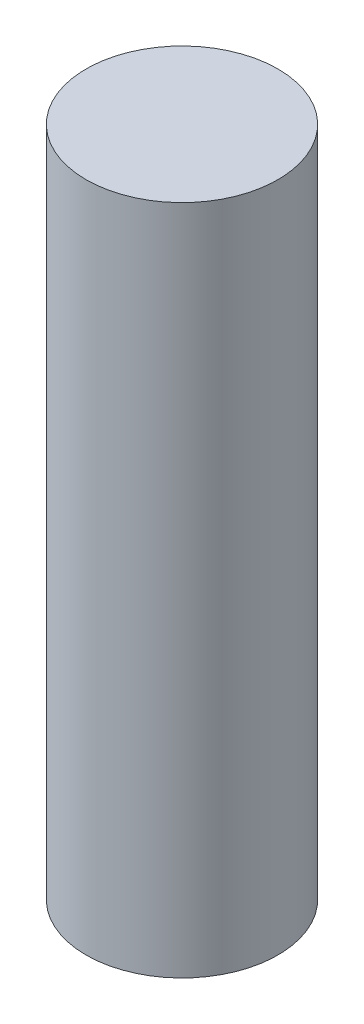
ISO-10303-21;
HEADER;
FILE_DESCRIPTION(('STEP AP214'),'2;1');
FILE_NAME('part.step','',(''),(''),'','','');
FILE_SCHEMA(('AUTOMOTIVE_DESIGN { 1 0 10303 214 1 1 1 1 }'));
ENDSEC;
DATA;
#1=APPLICATION_CONTEXT('core data for automotive mechanical design processes');
#2=APPLICATION_PROTOCOL_DEFINITION('international standard','automotive_design',2000,#1);
#3=PRODUCT_CONTEXT('',#1,'mechanical');
#4=PRODUCT('Part','Part','',(#3));
#5=PRODUCT_RELATED_PRODUCT_CATEGORY('part','',(#4));
#6=PRODUCT_DEFINITION_FORMATION('','',#4);
#7=PRODUCT_DEFINITION_CONTEXT('part definition',#1,'design');
#8=PRODUCT_DEFINITION('design','',#6,#7);
#9=PRODUCT_DEFINITION_SHAPE('','',#8);
#10=(LENGTH_UNIT() NAMED_UNIT(*) SI_UNIT(.MILLI.,.METRE.));
#11=(NAMED_UNIT(*) PLANE_ANGLE_UNIT() SI_UNIT($,.RADIAN.));
#12=(NAMED_UNIT(*) SI_UNIT($,.STERADIAN.) SOLID_ANGLE_UNIT());
#13=UNCERTAINTY_MEASURE_WITH_UNIT(LENGTH_MEASURE(1.E-05),#10,'distance_accuracy_value','');
#14=(GEOMETRIC_REPRESENTATION_CONTEXT(3) GLOBAL_UNCERTAINTY_ASSIGNED_CONTEXT((#13)) GLOBAL_UNIT_ASSIGNED_CONTEXT((#10,
#11,#12)) REPRESENTATION_CONTEXT('',''));
#15=CARTESIAN_POINT('',(0.,0.,0.));
#16=DIRECTION('',(0.,0.,1.));
#17=DIRECTION('',(1.,0.,0.));
#18=AXIS2_PLACEMENT_3D('',#15,#16,#17);
#19=CARTESIAN_POINT('',(0.,17.5,0.));
#20=DIRECTION('',(0.,-1.,0.));
#21=DIRECTION('',(0.,0.,-1.));
#22=AXIS2_PLACEMENT_3D('',#19,#20,#21);
#23=CYLINDRICAL_SURFACE('',#22,5.);
#24=CARTESIAN_POINT('',(0.,17.5,0.));
#25=DIRECTION('',(0.,1.,0.));
#26=DIRECTION('',(0.,0.,1.));
#27=AXIS2_PLACEMENT_3D('',#24,#25,#26);
#28=CIRCLE('',#27,5.);
#29=CARTESIAN_POINT('',(0.,17.5,5.));
#30=VERTEX_POINT('',#29);
#31=EDGE_CURVE('E10',#30,#30,#28,.T.);
#32=ORIENTED_EDGE('',*,*,#31,.F.);
#33=EDGE_LOOP('',(#32));
#34=FACE_BOUND('',#33,.T.);
#35=CARTESIAN_POINT('',(0.,-17.5,0.));
#36=DIRECTION('',(0.,1.,0.));
#37=DIRECTION('',(0.,0.,1.));
#38=AXIS2_PLACEMENT_3D('',#35,#36,#37);
#39=CIRCLE('',#38,5.);
#40=CARTESIAN_POINT('',(0.,-17.5,5.));
#41=VERTEX_POINT('',#40);
#42=EDGE_CURVE('E40',#41,#41,#39,.T.);
#43=ORIENTED_EDGE('',*,*,#42,.T.);
#44=EDGE_LOOP('',(#43));
#45=FACE_BOUND('',#44,.T.);
#46=ADVANCED_FACE('F37',(#34,#45),#23,.T.);
#47=CARTESIAN_POINT('',(0.,17.5,0.));
#48=DIRECTION('',(0.,1.,0.));
#49=DIRECTION('',(0.,0.,1.));
#50=AXIS2_PLACEMENT_3D('',#47,#48,#49);
#51=PLANE('',#50);
#52=ORIENTED_EDGE('',*,*,#31,.T.);
#53=EDGE_LOOP('',(#52));
#54=FACE_BOUND('',#53,.T.);
#55=ADVANCED_FACE('F54',(#54),#51,.T.);
#56=CARTESIAN_POINT('',(0.,-17.5,0.));
#57=DIRECTION('',(0.,1.,0.));
#58=DIRECTION('',(0.,0.,1.));
#59=AXIS2_PLACEMENT_3D('',#56,#57,#58);
#60=PLANE('',#59);
#61=ORIENTED_EDGE('',*,*,#42,.F.);
#62=EDGE_LOOP('',(#61));
#63=FACE_BOUND('',#62,.T.);
#64=ADVANCED_FACE('F52',(#63),#60,.F.);
#65=CLOSED_SHELL('',(#46,#55,#64));
#66=MANIFOLD_SOLID_BREP('B2',#65);
#67=ADVANCED_BREP_SHAPE_REPRESENTATION('',(#18,#66),#14);
#68=SHAPE_DEFINITION_REPRESENTATION(#9,#67);
ENDSEC;
END-ISO-10303-21;
